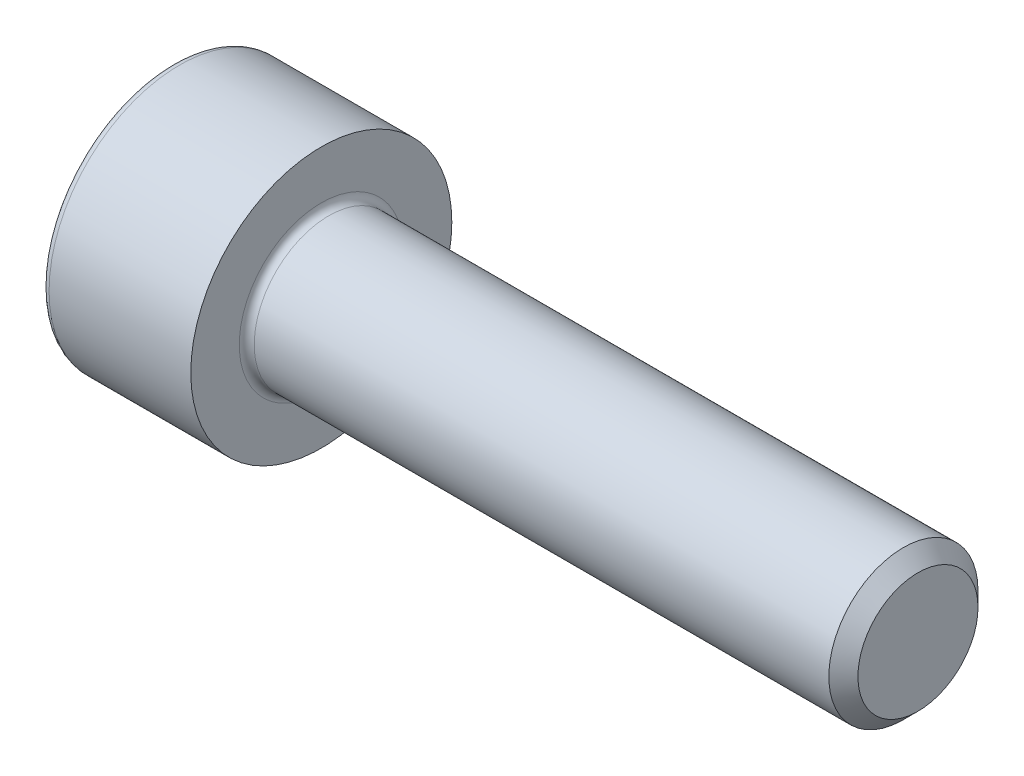
ISO-10303-21;
HEADER;
FILE_DESCRIPTION(('STEP AP214'),'2;1');
FILE_NAME('part.step','',(''),(''),'','','');
FILE_SCHEMA(('AUTOMOTIVE_DESIGN { 1 0 10303 214 1 1 1 1 }'));
ENDSEC;
DATA;
#1=APPLICATION_CONTEXT('core data for automotive mechanical design processes');
#2=APPLICATION_PROTOCOL_DEFINITION('international standard','automotive_design',2000,#1);
#3=PRODUCT_CONTEXT('',#1,'mechanical');
#4=PRODUCT('Part','Part','',(#3));
#5=PRODUCT_RELATED_PRODUCT_CATEGORY('part','',(#4));
#6=PRODUCT_DEFINITION_FORMATION('','',#4);
#7=PRODUCT_DEFINITION_CONTEXT('part definition',#1,'design');
#8=PRODUCT_DEFINITION('design','',#6,#7);
#9=PRODUCT_DEFINITION_SHAPE('','',#8);
#10=(LENGTH_UNIT() NAMED_UNIT(*) SI_UNIT(.MILLI.,.METRE.));
#11=(NAMED_UNIT(*) PLANE_ANGLE_UNIT() SI_UNIT($,.RADIAN.));
#12=(NAMED_UNIT(*) SI_UNIT($,.STERADIAN.) SOLID_ANGLE_UNIT());
#13=UNCERTAINTY_MEASURE_WITH_UNIT(LENGTH_MEASURE(1.E-05),#10,'distance_accuracy_value','');
#14=(GEOMETRIC_REPRESENTATION_CONTEXT(3) GLOBAL_UNCERTAINTY_ASSIGNED_CONTEXT((#13)) GLOBAL_UNIT_ASSIGNED_CONTEXT((#10,
#11,#12)) REPRESENTATION_CONTEXT('',''));
#15=CARTESIAN_POINT('',(0.,0.,0.));
#16=DIRECTION('',(0.,0.,1.));
#17=DIRECTION('',(1.,0.,0.));
#18=AXIS2_PLACEMENT_3D('',#15,#16,#17);
#19=CARTESIAN_POINT('',(2.,0.,0.));
#20=DIRECTION('',(-1.,0.,0.));
#21=DIRECTION('',(0.,0.,1.));
#22=AXIS2_PLACEMENT_3D('',#19,#20,#21);
#23=PLANE('',#22);
#24=DIRECTION('',(0.,-1.,0.));
#25=VECTOR('',#24,1.);
#26=CARTESIAN_POINT('',(2.,0.886521338340664,-1.5355));
#27=LINE('',#26,#25);
#28=CARTESIAN_POINT('',(2.,0.886521338340664,-1.5355));
#29=VERTEX_POINT('',#28);
#30=CARTESIAN_POINT('',(2.,0.,-1.5355));
#31=VERTEX_POINT('',#30);
#32=EDGE_CURVE('E174',#29,#31,#27,.T.);
#33=ORIENTED_EDGE('',*,*,#32,.T.);
#34=CARTESIAN_POINT('',(2.,0.,0.));
#35=DIRECTION('',(1.,0.,0.));
#36=DIRECTION('',(0.,0.,-1.));
#37=AXIS2_PLACEMENT_3D('',#34,#35,#36);
#38=CIRCLE('',#37,1.5355);
#39=CARTESIAN_POINT('',(2.,1.329782007511,-0.767750000000002));
#40=VERTEX_POINT('',#39);
#41=EDGE_CURVE('E47',#31,#40,#38,.T.);
#42=ORIENTED_EDGE('',*,*,#41,.T.);
#43=DIRECTION('',(0.,-0.500000000000001,-0.866025403784438));
#44=VECTOR('',#43,1.);
#45=CARTESIAN_POINT('',(2.,1.77304267668133,0.));
#46=LINE('',#45,#44);
#47=EDGE_CURVE('E170',#40,#29,#46,.T.);
#48=ORIENTED_EDGE('',*,*,#47,.T.);
#49=EDGE_LOOP('',(#33,#42,#48));
#50=FACE_BOUND('',#49,.T.);
#51=ADVANCED_FACE('F32',(#50),#23,.T.);
#52=CARTESIAN_POINT('',(2.,1.77304267668133,0.));
#53=VERTEX_POINT('',#52);
#54=EDGE_CURVE('E171',#53,#40,#46,.T.);
#55=ORIENTED_EDGE('',*,*,#54,.T.);
#56=CARTESIAN_POINT('',(2.,1.32978200751101,0.767749999999998));
#57=VERTEX_POINT('',#56);
#58=EDGE_CURVE('E210',#40,#57,#38,.T.);
#59=ORIENTED_EDGE('',*,*,#58,.T.);
#60=DIRECTION('',(0.,0.499999999999998,-0.86602540378444));
#61=VECTOR('',#60,1.);
#62=CARTESIAN_POINT('',(2.,0.886521338340667,1.5355));
#63=LINE('',#62,#61);
#64=EDGE_CURVE('E166',#57,#53,#63,.T.);
#65=ORIENTED_EDGE('',*,*,#64,.T.);
#66=EDGE_LOOP('',(#55,#59,#65));
#67=FACE_BOUND('',#66,.T.);
#68=ADVANCED_FACE('F122',(#67),#23,.T.);
#69=CARTESIAN_POINT('',(2.,0.886521338340667,1.5355));
#70=VERTEX_POINT('',#69);
#71=EDGE_CURVE('E167',#70,#57,#63,.T.);
#72=ORIENTED_EDGE('',*,*,#71,.T.);
#73=CARTESIAN_POINT('',(2.,0.,1.5355));
#74=VERTEX_POINT('',#73);
#75=EDGE_CURVE('E284',#57,#74,#38,.T.);
#76=ORIENTED_EDGE('',*,*,#75,.T.);
#77=DIRECTION('',(0.,1.,0.));
#78=VECTOR('',#77,1.);
#79=CARTESIAN_POINT('',(2.,-0.886521338340674,1.5355));
#80=LINE('',#79,#78);
#81=EDGE_CURVE('E162',#74,#70,#80,.T.);
#82=ORIENTED_EDGE('',*,*,#81,.T.);
#83=EDGE_LOOP('',(#72,#76,#82));
#84=FACE_BOUND('',#83,.T.);
#85=ADVANCED_FACE('F128',(#84),#23,.T.);
#86=CARTESIAN_POINT('',(2.,-0.886521338340674,1.5355));
#87=VERTEX_POINT('',#86);
#88=EDGE_CURVE('E163',#87,#74,#80,.T.);
#89=ORIENTED_EDGE('',*,*,#88,.T.);
#90=CARTESIAN_POINT('',(2.,-1.32978200751101,0.767750000000001));
#91=VERTEX_POINT('',#90);
#92=EDGE_CURVE('E283',#74,#91,#38,.T.);
#93=ORIENTED_EDGE('',*,*,#92,.T.);
#94=DIRECTION('',(0.,0.5,0.866025403784438));
#95=VECTOR('',#94,1.);
#96=CARTESIAN_POINT('',(2.,-1.77304267668134,0.));
#97=LINE('',#96,#95);
#98=EDGE_CURVE('E153',#91,#87,#97,.T.);
#99=ORIENTED_EDGE('',*,*,#98,.T.);
#100=EDGE_LOOP('',(#89,#93,#99));
#101=FACE_BOUND('',#100,.T.);
#102=ADVANCED_FACE('F143',(#101),#23,.T.);
#103=CARTESIAN_POINT('',(2.,-1.77304267668134,0.));
#104=VERTEX_POINT('',#103);
#105=EDGE_CURVE('E156',#104,#91,#97,.T.);
#106=ORIENTED_EDGE('',*,*,#105,.T.);
#107=CARTESIAN_POINT('',(2.,-1.32978200751101,-0.767749999999998));
#108=VERTEX_POINT('',#107);
#109=EDGE_CURVE('E281',#91,#108,#38,.T.);
#110=ORIENTED_EDGE('',*,*,#109,.T.);
#111=DIRECTION('',(0.,-0.499999999999999,0.866025403784439));
#112=VECTOR('',#111,1.);
#113=CARTESIAN_POINT('',(2.,-0.886521338340677,-1.5355));
#114=LINE('',#113,#112);
#115=EDGE_CURVE('E154',#108,#104,#114,.T.);
#116=ORIENTED_EDGE('',*,*,#115,.T.);
#117=EDGE_LOOP('',(#106,#110,#116));
#118=FACE_BOUND('',#117,.T.);
#119=ADVANCED_FACE('F134',(#118),#23,.T.);
#120=CARTESIAN_POINT('',(2.,-0.886521338340677,-1.5355));
#121=VERTEX_POINT('',#120);
#122=EDGE_CURVE('E147',#121,#108,#114,.T.);
#123=ORIENTED_EDGE('',*,*,#122,.T.);
#124=EDGE_CURVE('E148',#108,#31,#38,.T.);
#125=ORIENTED_EDGE('',*,*,#124,.T.);
#126=EDGE_CURVE('E150',#31,#121,#27,.T.);
#127=ORIENTED_EDGE('',*,*,#126,.T.);
#128=EDGE_LOOP('',(#123,#125,#127));
#129=FACE_BOUND('',#128,.T.);
#130=ADVANCED_FACE('F124',(#129),#23,.T.);
#131=CARTESIAN_POINT('',(4.,3.5,0.));
#132=DIRECTION('',(1.,0.,0.));
#133=DIRECTION('',(0.,0.,-1.));
#134=AXIS2_PLACEMENT_3D('',#131,#132,#133);
#135=PLANE('',#134);
#136=CARTESIAN_POINT('',(4.,0.,0.));
#137=DIRECTION('',(1.,0.,0.));
#138=DIRECTION('',(0.,0.,-1.));
#139=AXIS2_PLACEMENT_3D('',#136,#137,#138);
#140=CIRCLE('',#139,2.2);
#141=CARTESIAN_POINT('',(4.,0.,-2.2));
#142=VERTEX_POINT('',#141);
#143=EDGE_CURVE('E11',#142,#142,#140,.F.);
#144=ORIENTED_EDGE('',*,*,#143,.T.);
#145=EDGE_LOOP('',(#144));
#146=FACE_BOUND('',#145,.T.);
#147=CARTESIAN_POINT('',(4.,0.,0.));
#148=DIRECTION('',(-1.,0.,0.));
#149=DIRECTION('',(0.,0.,1.));
#150=AXIS2_PLACEMENT_3D('',#147,#148,#149);
#151=CIRCLE('',#150,3.5);
#152=CARTESIAN_POINT('',(4.,0.,3.5));
#153=VERTEX_POINT('',#152);
#154=EDGE_CURVE('E194',#153,#153,#151,.T.);
#155=ORIENTED_EDGE('',*,*,#154,.F.);
#156=EDGE_LOOP('',(#155));
#157=FACE_BOUND('',#156,.T.);
#158=ADVANCED_FACE('F133',(#146,#157),#135,.T.);
#159=CARTESIAN_POINT('',(4.,0.,0.));
#160=DIRECTION('',(-1.,0.,0.));
#161=DIRECTION('',(0.,0.,1.));
#162=AXIS2_PLACEMENT_3D('',#159,#160,#161);
#163=CYLINDRICAL_SURFACE('',#162,3.5);
#164=CARTESIAN_POINT('',(0.2,0.,0.));
#165=DIRECTION('',(-1.,0.,0.));
#166=DIRECTION('',(0.,0.,1.));
#167=AXIS2_PLACEMENT_3D('',#164,#165,#166);
#168=CIRCLE('',#167,3.5);
#169=CARTESIAN_POINT('',(0.2,0.,3.5));
#170=VERTEX_POINT('',#169);
#171=EDGE_CURVE('E216',#170,#170,#168,.F.);
#172=ORIENTED_EDGE('',*,*,#171,.T.);
#173=EDGE_LOOP('',(#172));
#174=FACE_BOUND('',#173,.T.);
#175=ORIENTED_EDGE('',*,*,#154,.T.);
#176=EDGE_LOOP('',(#175));
#177=FACE_BOUND('',#176,.T.);
#178=ADVANCED_FACE('F140',(#174,#177),#163,.T.);
#179=CARTESIAN_POINT('',(0.,0.,0.));
#180=DIRECTION('',(-1.,0.,0.));
#181=DIRECTION('',(0.,0.,1.));
#182=AXIS2_PLACEMENT_3D('',#179,#180,#181);
#183=PLANE('',#182);
#184=CARTESIAN_POINT('',(0.,0.,0.));
#185=DIRECTION('',(-1.,0.,0.));
#186=DIRECTION('',(0.,0.,1.));
#187=AXIS2_PLACEMENT_3D('',#184,#185,#186);
#188=CIRCLE('',#187,3.3);
#189=CARTESIAN_POINT('',(0.,0.,3.3));
#190=VERTEX_POINT('',#189);
#191=EDGE_CURVE('E213',#190,#190,#188,.T.);
#192=ORIENTED_EDGE('',*,*,#191,.T.);
#193=EDGE_LOOP('',(#192));
#194=FACE_BOUND('',#193,.T.);
#195=DIRECTION('',(0.,-0.499999999999999,0.866025403784439));
#196=VECTOR('',#195,1.);
#197=CARTESIAN_POINT('',(0.,-0.886521338340677,-1.5355));
#198=LINE('',#197,#196);
#199=CARTESIAN_POINT('',(0.,-0.886521338340677,-1.5355));
#200=VERTEX_POINT('',#199);
#201=CARTESIAN_POINT('',(0.,-1.77304267668135,0.));
#202=VERTEX_POINT('',#201);
#203=EDGE_CURVE('E55',#200,#202,#198,.T.);
#204=ORIENTED_EDGE('',*,*,#203,.F.);
#205=DIRECTION('',(0.,-1.,0.));
#206=VECTOR('',#205,1.);
#207=CARTESIAN_POINT('',(0.,0.886521338340664,-1.5355));
#208=LINE('',#207,#206);
#209=CARTESIAN_POINT('',(0.,0.886521338340664,-1.5355));
#210=VERTEX_POINT('',#209);
#211=EDGE_CURVE('E158',#210,#200,#208,.T.);
#212=ORIENTED_EDGE('',*,*,#211,.F.);
#213=DIRECTION('',(0.,-0.500000000000001,-0.866025403784438));
#214=VECTOR('',#213,1.);
#215=CARTESIAN_POINT('',(0.,1.77304267668133,0.));
#216=LINE('',#215,#214);
#217=CARTESIAN_POINT('',(0.,1.77304267668133,0.));
#218=VERTEX_POINT('',#217);
#219=EDGE_CURVE('E187',#218,#210,#216,.T.);
#220=ORIENTED_EDGE('',*,*,#219,.F.);
#221=DIRECTION('',(0.,0.499999999999998,-0.86602540378444));
#222=VECTOR('',#221,1.);
#223=CARTESIAN_POINT('',(0.,0.886521338340667,1.5355));
#224=LINE('',#223,#222);
#225=CARTESIAN_POINT('',(0.,0.886521338340667,1.5355));
#226=VERTEX_POINT('',#225);
#227=EDGE_CURVE('E184',#226,#218,#224,.T.);
#228=ORIENTED_EDGE('',*,*,#227,.F.);
#229=DIRECTION('',(0.,1.,0.));
#230=VECTOR('',#229,1.);
#231=CARTESIAN_POINT('',(0.,-0.886521338340674,1.5355));
#232=LINE('',#231,#230);
#233=CARTESIAN_POINT('',(0.,-0.886521338340674,1.5355));
#234=VERTEX_POINT('',#233);
#235=EDGE_CURVE('E181',#234,#226,#232,.T.);
#236=ORIENTED_EDGE('',*,*,#235,.F.);
#237=DIRECTION('',(0.,0.5,0.866025403784438));
#238=VECTOR('',#237,1.);
#239=CARTESIAN_POINT('',(0.,-1.77304267668134,0.));
#240=LINE('',#239,#238);
#241=EDGE_CURVE('E178',#202,#234,#240,.T.);
#242=ORIENTED_EDGE('',*,*,#241,.F.);
#243=EDGE_LOOP('',(#204,#212,#220,#228,#236,#242));
#244=FACE_BOUND('',#243,.T.);
#245=ADVANCED_FACE('F235',(#194,#244),#183,.T.);
#246=CARTESIAN_POINT('',(20.,0.,0.));
#247=DIRECTION('',(-1.,0.,0.));
#248=DIRECTION('',(0.,0.,1.));
#249=AXIS2_PLACEMENT_3D('',#246,#247,#248);
#250=CYLINDRICAL_SURFACE('',#249,2.);
#251=CARTESIAN_POINT('',(4.2,0.,0.));
#252=DIRECTION('',(1.,0.,0.));
#253=DIRECTION('',(0.,0.,-1.));
#254=AXIS2_PLACEMENT_3D('',#251,#252,#253);
#255=CIRCLE('',#254,2.);
#256=CARTESIAN_POINT('',(4.2,0.,-2.));
#257=VERTEX_POINT('',#256);
#258=EDGE_CURVE('E40',#257,#257,#255,.T.);
#259=ORIENTED_EDGE('',*,*,#258,.T.);
#260=EDGE_LOOP('',(#259));
#261=FACE_BOUND('',#260,.T.);
#262=CARTESIAN_POINT('',(19.61,0.,0.));
#263=DIRECTION('',(1.,0.,0.));
#264=DIRECTION('',(0.,0.,-1.));
#265=AXIS2_PLACEMENT_3D('',#262,#263,#264);
#266=CIRCLE('',#265,2.);
#267=CARTESIAN_POINT('',(19.61,0.,-2.));
#268=VERTEX_POINT('',#267);
#269=EDGE_CURVE('E209',#268,#268,#266,.F.);
#270=ORIENTED_EDGE('',*,*,#269,.T.);
#271=EDGE_LOOP('',(#270));
#272=FACE_BOUND('',#271,.T.);
#273=ADVANCED_FACE('F221',(#261,#272),#250,.T.);
#274=CARTESIAN_POINT('',(20.,0.,0.));
#275=DIRECTION('',(1.,0.,0.));
#276=DIRECTION('',(0.,0.,-1.));
#277=AXIS2_PLACEMENT_3D('',#274,#275,#276);
#278=PLANE('',#277);
#279=CARTESIAN_POINT('',(20.,0.,0.));
#280=DIRECTION('',(1.,0.,0.));
#281=DIRECTION('',(0.,0.,-1.));
#282=AXIS2_PLACEMENT_3D('',#279,#280,#281);
#283=CIRCLE('',#282,1.61);
#284=CARTESIAN_POINT('',(20.,0.,-1.61));
#285=VERTEX_POINT('',#284);
#286=EDGE_CURVE('E206',#285,#285,#283,.T.);
#287=ORIENTED_EDGE('',*,*,#286,.T.);
#288=EDGE_LOOP('',(#287));
#289=FACE_BOUND('',#288,.T.);
#290=ADVANCED_FACE('F246',(#289),#278,.T.);
#291=CARTESIAN_POINT('',(2.,-0.886521338340677,-1.5355));
#292=DIRECTION('',(0.,-0.866025403784439,-0.499999999999999));
#293=DIRECTION('',(0.,0.499999999999999,-0.866025403784439));
#294=AXIS2_PLACEMENT_3D('',#291,#292,#293);
#295=PLANE('',#294);
#296=ORIENTED_EDGE('',*,*,#203,.T.);
#297=DIRECTION('',(-1.,0.,0.));
#298=VECTOR('',#297,1.);
#299=CARTESIAN_POINT('',(2.,-1.77304267668134,0.));
#300=LINE('',#299,#298);
#301=EDGE_CURVE('E176',#104,#202,#300,.T.);
#302=ORIENTED_EDGE('',*,*,#301,.F.);
#303=ORIENTED_EDGE('',*,*,#115,.F.);
#304=ORIENTED_EDGE('',*,*,#122,.F.);
#305=DIRECTION('',(-1.,0.,0.));
#306=VECTOR('',#305,1.);
#307=CARTESIAN_POINT('',(2.,-0.886521338340677,-1.5355));
#308=LINE('',#307,#306);
#309=EDGE_CURVE('E192',#121,#200,#308,.T.);
#310=ORIENTED_EDGE('',*,*,#309,.T.);
#311=EDGE_LOOP('',(#296,#302,#303,#304,#310));
#312=FACE_BOUND('',#311,.T.);
#313=ADVANCED_FACE('F249',(#312),#295,.F.);
#314=CARTESIAN_POINT('',(2.,0.886521338340664,-1.5355));
#315=DIRECTION('',(0.,0.,-1.));
#316=DIRECTION('',(-1.,0.,0.));
#317=AXIS2_PLACEMENT_3D('',#314,#315,#316);
#318=PLANE('',#317);
#319=ORIENTED_EDGE('',*,*,#211,.T.);
#320=ORIENTED_EDGE('',*,*,#309,.F.);
#321=ORIENTED_EDGE('',*,*,#126,.F.);
#322=ORIENTED_EDGE('',*,*,#32,.F.);
#323=DIRECTION('',(-1.,0.,0.));
#324=VECTOR('',#323,1.);
#325=CARTESIAN_POINT('',(2.,0.886521338340664,-1.5355));
#326=LINE('',#325,#324);
#327=EDGE_CURVE('E195',#29,#210,#326,.T.);
#328=ORIENTED_EDGE('',*,*,#327,.T.);
#329=EDGE_LOOP('',(#319,#320,#321,#322,#328));
#330=FACE_BOUND('',#329,.T.);
#331=ADVANCED_FACE('F252',(#330),#318,.F.);
#332=CARTESIAN_POINT('',(2.,1.77304267668133,0.));
#333=DIRECTION('',(0.,0.866025403784438,-0.500000000000001));
#334=DIRECTION('',(0.,0.500000000000001,0.866025403784438));
#335=AXIS2_PLACEMENT_3D('',#332,#333,#334);
#336=PLANE('',#335);
#337=ORIENTED_EDGE('',*,*,#219,.T.);
#338=ORIENTED_EDGE('',*,*,#327,.F.);
#339=ORIENTED_EDGE('',*,*,#47,.F.);
#340=ORIENTED_EDGE('',*,*,#54,.F.);
#341=DIRECTION('',(-1.,0.,0.));
#342=VECTOR('',#341,1.);
#343=CARTESIAN_POINT('',(2.,1.77304267668133,0.));
#344=LINE('',#343,#342);
#345=EDGE_CURVE('E197',#53,#218,#344,.T.);
#346=ORIENTED_EDGE('',*,*,#345,.T.);
#347=EDGE_LOOP('',(#337,#338,#339,#340,#346));
#348=FACE_BOUND('',#347,.T.);
#349=ADVANCED_FACE('F260',(#348),#336,.F.);
#350=CARTESIAN_POINT('',(2.,0.886521338340667,1.5355));
#351=DIRECTION('',(0.,0.86602540378444,0.499999999999998));
#352=DIRECTION('',(0.,-0.499999999999998,0.86602540378444));
#353=AXIS2_PLACEMENT_3D('',#350,#351,#352);
#354=PLANE('',#353);
#355=ORIENTED_EDGE('',*,*,#227,.T.);
#356=ORIENTED_EDGE('',*,*,#345,.F.);
#357=ORIENTED_EDGE('',*,*,#64,.F.);
#358=ORIENTED_EDGE('',*,*,#71,.F.);
#359=DIRECTION('',(-1.,0.,0.));
#360=VECTOR('',#359,1.);
#361=CARTESIAN_POINT('',(2.,0.886521338340667,1.5355));
#362=LINE('',#361,#360);
#363=EDGE_CURVE('E199',#70,#226,#362,.T.);
#364=ORIENTED_EDGE('',*,*,#363,.T.);
#365=EDGE_LOOP('',(#355,#356,#357,#358,#364));
#366=FACE_BOUND('',#365,.T.);
#367=ADVANCED_FACE('F256',(#366),#354,.F.);
#368=CARTESIAN_POINT('',(2.,-0.886521338340674,1.5355));
#369=DIRECTION('',(0.,0.,1.));
#370=DIRECTION('',(1.,0.,0.));
#371=AXIS2_PLACEMENT_3D('',#368,#369,#370);
#372=PLANE('',#371);
#373=ORIENTED_EDGE('',*,*,#235,.T.);
#374=ORIENTED_EDGE('',*,*,#363,.F.);
#375=ORIENTED_EDGE('',*,*,#81,.F.);
#376=ORIENTED_EDGE('',*,*,#88,.F.);
#377=DIRECTION('',(-1.,0.,0.));
#378=VECTOR('',#377,1.);
#379=CARTESIAN_POINT('',(2.,-0.886521338340674,1.5355));
#380=LINE('',#379,#378);
#381=EDGE_CURVE('E201',#87,#234,#380,.T.);
#382=ORIENTED_EDGE('',*,*,#381,.T.);
#383=EDGE_LOOP('',(#373,#374,#375,#376,#382));
#384=FACE_BOUND('',#383,.T.);
#385=ADVANCED_FACE('F117',(#384),#372,.F.);
#386=CARTESIAN_POINT('',(2.,-1.77304267668134,0.));
#387=DIRECTION('',(0.,-0.866025403784438,0.5));
#388=DIRECTION('',(0.,-0.5,-0.866025403784438));
#389=AXIS2_PLACEMENT_3D('',#386,#387,#388);
#390=PLANE('',#389);
#391=ORIENTED_EDGE('',*,*,#241,.T.);
#392=ORIENTED_EDGE('',*,*,#381,.F.);
#393=ORIENTED_EDGE('',*,*,#98,.F.);
#394=ORIENTED_EDGE('',*,*,#105,.F.);
#395=ORIENTED_EDGE('',*,*,#301,.T.);
#396=EDGE_LOOP('',(#391,#392,#393,#394,#395));
#397=FACE_BOUND('',#396,.T.);
#398=ADVANCED_FACE('F108',(#397),#390,.F.);
#399=CARTESIAN_POINT('',(2.88652133834068,0.,0.));
#400=DIRECTION('',(-1.,0.,0.));
#401=DIRECTION('',(0.,0.,1.));
#402=AXIS2_PLACEMENT_3D('',#399,#400,#401);
#403=CONICAL_SURFACE('',#402,0.,1.04719755119659);
#404=ORIENTED_EDGE('',*,*,#41,.F.);
#405=ORIENTED_EDGE('',*,*,#124,.F.);
#406=ORIENTED_EDGE('',*,*,#109,.F.);
#407=ORIENTED_EDGE('',*,*,#92,.F.);
#408=ORIENTED_EDGE('',*,*,#75,.F.);
#409=ORIENTED_EDGE('',*,*,#58,.F.);
#410=EDGE_LOOP('',(#404,#405,#406,#407,#408,#409));
#411=FACE_BOUND('',#410,.T.);
#412=CARTESIAN_POINT('',(2.88652133834068,0.,0.));
#413=VERTEX_POINT('',#412);
#414=VERTEX_LOOP('',#413);
#415=FACE_BOUND('',#414,.T.);
#416=ADVANCED_FACE('F105',(#411,#415),#403,.F.);
#417=CARTESIAN_POINT('',(20.,0.,0.));
#418=DIRECTION('',(-1.,0.,0.));
#419=DIRECTION('',(0.,0.,1.));
#420=AXIS2_PLACEMENT_3D('',#417,#418,#419);
#421=CONICAL_SURFACE('',#420,1.61,0.785398163397504);
#422=ORIENTED_EDGE('',*,*,#269,.F.);
#423=EDGE_LOOP('',(#422));
#424=FACE_BOUND('',#423,.T.);
#425=ORIENTED_EDGE('',*,*,#286,.F.);
#426=EDGE_LOOP('',(#425));
#427=FACE_BOUND('',#426,.T.);
#428=ADVANCED_FACE('F107',(#424,#427),#421,.T.);
#429=CARTESIAN_POINT('',(0.2,0.,0.));
#430=DIRECTION('',(-1.,0.,0.));
#431=DIRECTION('',(0.,0.,1.));
#432=AXIS2_PLACEMENT_3D('',#429,#430,#431);
#433=TOROIDAL_SURFACE('',#432,3.3,0.2);
#434=ORIENTED_EDGE('',*,*,#171,.F.);
#435=EDGE_LOOP('',(#434));
#436=FACE_BOUND('',#435,.T.);
#437=ORIENTED_EDGE('',*,*,#191,.F.);
#438=EDGE_LOOP('',(#437));
#439=FACE_BOUND('',#438,.T.);
#440=ADVANCED_FACE('F114',(#436,#439),#433,.T.);
#441=CARTESIAN_POINT('',(4.2,0.,0.));
#442=DIRECTION('',(1.,0.,0.));
#443=DIRECTION('',(0.,0.,-1.));
#444=AXIS2_PLACEMENT_3D('',#441,#442,#443);
#445=TOROIDAL_SURFACE('',#444,2.2,0.2);
#446=ORIENTED_EDGE('',*,*,#143,.F.);
#447=EDGE_LOOP('',(#446));
#448=FACE_BOUND('',#447,.T.);
#449=ORIENTED_EDGE('',*,*,#258,.F.);
#450=EDGE_LOOP('',(#449));
#451=FACE_BOUND('',#450,.T.);
#452=ADVANCED_FACE('F34',(#448,#451),#445,.F.);
#453=CLOSED_SHELL('',(#51,#68,#85,#102,#119,#130,#158,#178,#245,#273,#290,#313,#331,#349,#367,
#385,#398,#416,#428,#440,#452));
#454=MANIFOLD_SOLID_BREP('B2',#453);
#455=ADVANCED_BREP_SHAPE_REPRESENTATION('',(#18,#454),#14);
#456=SHAPE_DEFINITION_REPRESENTATION(#9,#455);
ENDSEC;
END-ISO-10303-21;
